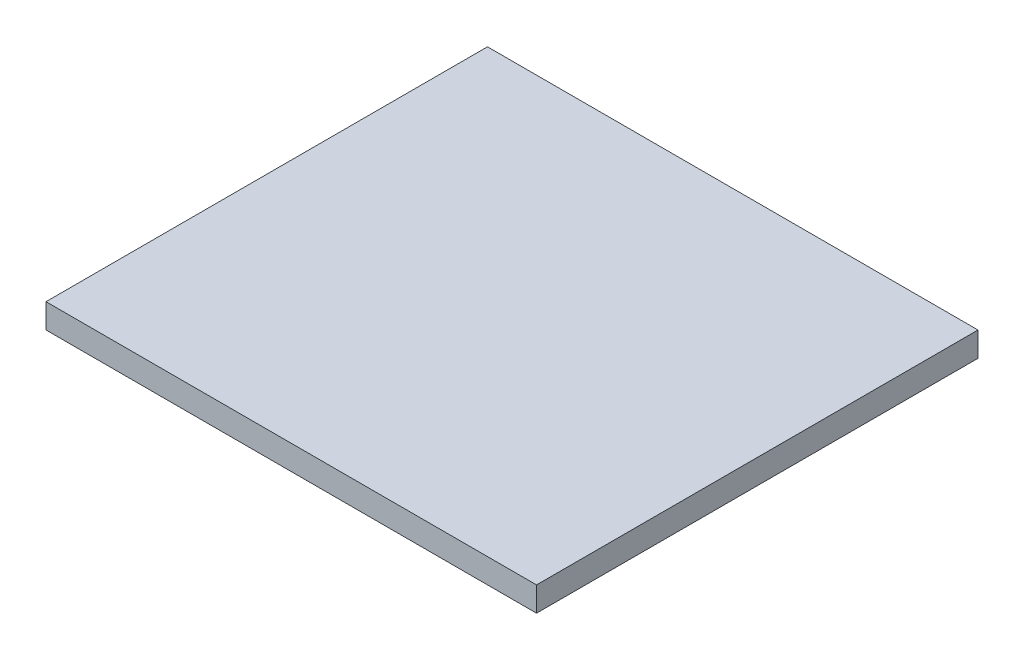
ISO-10303-21;
HEADER;
FILE_DESCRIPTION(('STEP AP214'),'2;1');
FILE_NAME('part.step','',(''),(''),'','','');
FILE_SCHEMA(('AUTOMOTIVE_DESIGN { 1 0 10303 214 1 1 1 1 }'));
ENDSEC;
DATA;
#1=APPLICATION_CONTEXT('core data for automotive mechanical design processes');
#2=APPLICATION_PROTOCOL_DEFINITION('international standard','automotive_design',2000,#1);
#3=PRODUCT_CONTEXT('',#1,'mechanical');
#4=PRODUCT('Part','Part','',(#3));
#5=PRODUCT_RELATED_PRODUCT_CATEGORY('part','',(#4));
#6=PRODUCT_DEFINITION_FORMATION('','',#4);
#7=PRODUCT_DEFINITION_CONTEXT('part definition',#1,'design');
#8=PRODUCT_DEFINITION('design','',#6,#7);
#9=PRODUCT_DEFINITION_SHAPE('','',#8);
#10=(LENGTH_UNIT() NAMED_UNIT(*) SI_UNIT(.MILLI.,.METRE.));
#11=(NAMED_UNIT(*) PLANE_ANGLE_UNIT() SI_UNIT($,.RADIAN.));
#12=(NAMED_UNIT(*) SI_UNIT($,.STERADIAN.) SOLID_ANGLE_UNIT());
#13=UNCERTAINTY_MEASURE_WITH_UNIT(LENGTH_MEASURE(1.E-05),#10,'distance_accuracy_value','');
#14=(GEOMETRIC_REPRESENTATION_CONTEXT(3) GLOBAL_UNCERTAINTY_ASSIGNED_CONTEXT((#13)) GLOBAL_UNIT_ASSIGNED_CONTEXT((#10,
#11,#12)) REPRESENTATION_CONTEXT('',''));
#15=CARTESIAN_POINT('',(0.,0.,0.));
#16=DIRECTION('',(0.,0.,1.));
#17=DIRECTION('',(1.,0.,0.));
#18=AXIS2_PLACEMENT_3D('',#15,#16,#17);
#19=CARTESIAN_POINT('',(64.8372777645808,2.54,-172.823188414021));
#20=DIRECTION('',(1.,0.,0.));
#21=DIRECTION('',(0.,0.,-1.));
#22=AXIS2_PLACEMENT_3D('',#19,#20,#21);
#23=PLANE('',#22);
#24=DIRECTION('',(0.,0.,1.));
#25=VECTOR('',#24,1.);
#26=CARTESIAN_POINT('',(64.8372777645808,0.,-172.823188414021));
#27=LINE('',#26,#25);
#28=CARTESIAN_POINT('',(64.8372777645808,0.,-172.823188414021));
#29=VERTEX_POINT('',#28);
#30=CARTESIAN_POINT('',(64.8372777645809,0.,-127.103188414021));
#31=VERTEX_POINT('',#30);
#32=EDGE_CURVE('E96',#29,#31,#27,.T.);
#33=ORIENTED_EDGE('',*,*,#32,.T.);
#34=DIRECTION('',(0.,-1.,0.));
#35=VECTOR('',#34,1.);
#36=CARTESIAN_POINT('',(64.8372777645809,2.54,-127.103188414021));
#37=LINE('',#36,#35);
#38=CARTESIAN_POINT('',(64.8372777645809,2.54,-127.103188414021));
#39=VERTEX_POINT('',#38);
#40=EDGE_CURVE('E11',#39,#31,#37,.T.);
#41=ORIENTED_EDGE('',*,*,#40,.F.);
#42=DIRECTION('',(0.,0.,1.));
#43=VECTOR('',#42,1.);
#44=CARTESIAN_POINT('',(64.8372777645808,2.54,-172.823188414021));
#45=LINE('',#44,#43);
#46=CARTESIAN_POINT('',(64.8372777645808,2.54,-172.823188414021));
#47=VERTEX_POINT('',#46);
#48=EDGE_CURVE('E84',#47,#39,#45,.T.);
#49=ORIENTED_EDGE('',*,*,#48,.F.);
#50=DIRECTION('',(0.,-1.,0.));
#51=VECTOR('',#50,1.);
#52=CARTESIAN_POINT('',(64.8372777645808,2.54,-172.823188414021));
#53=LINE('',#52,#51);
#54=EDGE_CURVE('E92',#47,#29,#53,.T.);
#55=ORIENTED_EDGE('',*,*,#54,.T.);
#56=EDGE_LOOP('',(#33,#41,#49,#55));
#57=FACE_BOUND('',#56,.T.);
#58=ADVANCED_FACE('F33',(#57),#23,.F.);
#59=CARTESIAN_POINT('',(64.8372777645809,2.54,-127.103188414021));
#60=DIRECTION('',(0.,0.,-1.));
#61=DIRECTION('',(-1.,0.,0.));
#62=AXIS2_PLACEMENT_3D('',#59,#60,#61);
#63=PLANE('',#62);
#64=DIRECTION('',(1.,0.,0.));
#65=VECTOR('',#64,1.);
#66=CARTESIAN_POINT('',(64.8372777645809,0.,-127.103188414021));
#67=LINE('',#66,#65);
#68=CARTESIAN_POINT('',(115.637277764581,0.,-127.103188414021));
#69=VERTEX_POINT('',#68);
#70=EDGE_CURVE('E88',#31,#69,#67,.T.);
#71=ORIENTED_EDGE('',*,*,#70,.T.);
#72=DIRECTION('',(0.,-1.,0.));
#73=VECTOR('',#72,1.);
#74=CARTESIAN_POINT('',(115.637277764581,2.54,-127.103188414021));
#75=LINE('',#74,#73);
#76=CARTESIAN_POINT('',(115.637277764581,2.54,-127.103188414021));
#77=VERTEX_POINT('',#76);
#78=EDGE_CURVE('E41',#77,#69,#75,.T.);
#79=ORIENTED_EDGE('',*,*,#78,.F.);
#80=DIRECTION('',(1.,0.,0.));
#81=VECTOR('',#80,1.);
#82=CARTESIAN_POINT('',(64.8372777645809,2.54,-127.103188414021));
#83=LINE('',#82,#81);
#84=EDGE_CURVE('E79',#39,#77,#83,.T.);
#85=ORIENTED_EDGE('',*,*,#84,.F.);
#86=ORIENTED_EDGE('',*,*,#40,.T.);
#87=EDGE_LOOP('',(#71,#79,#85,#86));
#88=FACE_BOUND('',#87,.T.);
#89=ADVANCED_FACE('F87',(#88),#63,.F.);
#90=CARTESIAN_POINT('',(115.637277764581,2.54,-172.823188414021));
#91=DIRECTION('',(-1.,0.,0.));
#92=DIRECTION('',(0.,0.,1.));
#93=AXIS2_PLACEMENT_3D('',#90,#91,#92);
#94=PLANE('',#93);
#95=DIRECTION('',(0.,0.,-1.));
#96=VECTOR('',#95,1.);
#97=CARTESIAN_POINT('',(115.637277764581,0.,-172.823188414021));
#98=LINE('',#97,#96);
#99=CARTESIAN_POINT('',(115.637277764581,0.,-172.823188414021));
#100=VERTEX_POINT('',#99);
#101=EDGE_CURVE('E66',#69,#100,#98,.T.);
#102=ORIENTED_EDGE('',*,*,#101,.T.);
#103=DIRECTION('',(0.,-1.,0.));
#104=VECTOR('',#103,1.);
#105=CARTESIAN_POINT('',(115.637277764581,2.54,-172.823188414021));
#106=LINE('',#105,#104);
#107=CARTESIAN_POINT('',(115.637277764581,2.54,-172.823188414021));
#108=VERTEX_POINT('',#107);
#109=EDGE_CURVE('E89',#108,#100,#106,.T.);
#110=ORIENTED_EDGE('',*,*,#109,.F.);
#111=DIRECTION('',(0.,0.,-1.));
#112=VECTOR('',#111,1.);
#113=CARTESIAN_POINT('',(115.637277764581,2.54,-172.823188414021));
#114=LINE('',#113,#112);
#115=EDGE_CURVE('E82',#77,#108,#114,.T.);
#116=ORIENTED_EDGE('',*,*,#115,.F.);
#117=ORIENTED_EDGE('',*,*,#78,.T.);
#118=EDGE_LOOP('',(#102,#110,#116,#117));
#119=FACE_BOUND('',#118,.T.);
#120=ADVANCED_FACE('F90',(#119),#94,.F.);
#121=CARTESIAN_POINT('',(64.8372777645808,2.54,-172.823188414021));
#122=DIRECTION('',(0.,0.,1.));
#123=DIRECTION('',(1.,0.,0.));
#124=AXIS2_PLACEMENT_3D('',#121,#122,#123);
#125=PLANE('',#124);
#126=DIRECTION('',(-1.,0.,0.));
#127=VECTOR('',#126,1.);
#128=CARTESIAN_POINT('',(64.8372777645808,0.,-172.823188414021));
#129=LINE('',#128,#127);
#130=EDGE_CURVE('E72',#100,#29,#129,.T.);
#131=ORIENTED_EDGE('',*,*,#130,.T.);
#132=ORIENTED_EDGE('',*,*,#54,.F.);
#133=DIRECTION('',(-1.,0.,0.));
#134=VECTOR('',#133,1.);
#135=CARTESIAN_POINT('',(64.8372777645808,2.54,-172.823188414021));
#136=LINE('',#135,#134);
#137=EDGE_CURVE('E49',#108,#47,#136,.T.);
#138=ORIENTED_EDGE('',*,*,#137,.F.);
#139=ORIENTED_EDGE('',*,*,#109,.T.);
#140=EDGE_LOOP('',(#131,#132,#138,#139));
#141=FACE_BOUND('',#140,.T.);
#142=ADVANCED_FACE('F103',(#141),#125,.F.);
#143=CARTESIAN_POINT('',(0.,2.54,0.));
#144=DIRECTION('',(0.,1.,0.));
#145=DIRECTION('',(0.,0.,1.));
#146=AXIS2_PLACEMENT_3D('',#143,#144,#145);
#147=PLANE('',#146);
#148=ORIENTED_EDGE('',*,*,#48,.T.);
#149=ORIENTED_EDGE('',*,*,#84,.T.);
#150=ORIENTED_EDGE('',*,*,#115,.T.);
#151=ORIENTED_EDGE('',*,*,#137,.T.);
#152=EDGE_LOOP('',(#148,#149,#150,#151));
#153=FACE_BOUND('',#152,.T.);
#154=ADVANCED_FACE('F80',(#153),#147,.T.);
#155=CARTESIAN_POINT('',(0.,0.,0.));
#156=DIRECTION('',(0.,1.,0.));
#157=DIRECTION('',(0.,0.,1.));
#158=AXIS2_PLACEMENT_3D('',#155,#156,#157);
#159=PLANE('',#158);
#160=ORIENTED_EDGE('',*,*,#32,.F.);
#161=ORIENTED_EDGE('',*,*,#130,.F.);
#162=ORIENTED_EDGE('',*,*,#101,.F.);
#163=ORIENTED_EDGE('',*,*,#70,.F.);
#164=EDGE_LOOP('',(#160,#161,#162,#163));
#165=FACE_BOUND('',#164,.T.);
#166=ADVANCED_FACE('F106',(#165),#159,.F.);
#167=CLOSED_SHELL('',(#58,#89,#120,#142,#154,#166));
#168=MANIFOLD_SOLID_BREP('B2',#167);
#169=ADVANCED_BREP_SHAPE_REPRESENTATION('',(#18,#168),#14);
#170=SHAPE_DEFINITION_REPRESENTATION(#9,#169);
ENDSEC;
END-ISO-10303-21;
